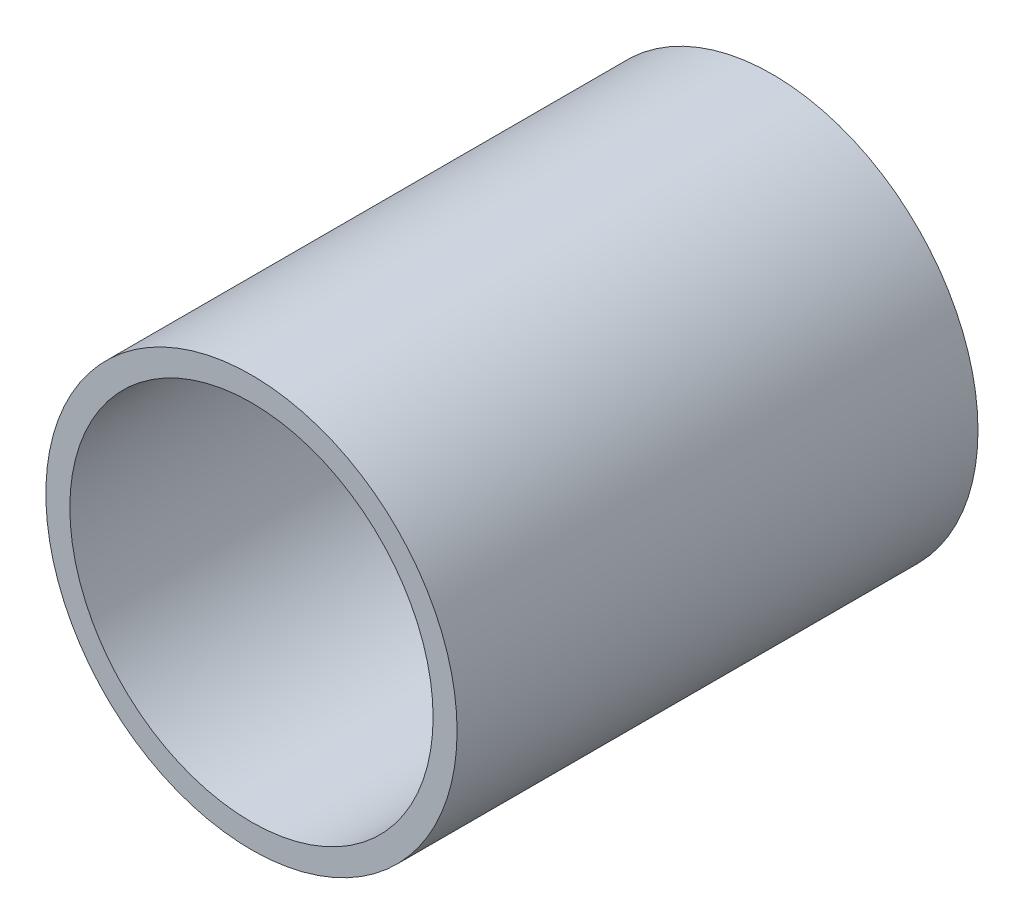
ISO-10303-21;
HEADER;
FILE_DESCRIPTION(('STEP AP214'),'2;1');
FILE_NAME('part.step','',(''),(''),'','','');
FILE_SCHEMA(('AUTOMOTIVE_DESIGN { 1 0 10303 214 1 1 1 1 }'));
ENDSEC;
DATA;
#1=APPLICATION_CONTEXT('core data for automotive mechanical design processes');
#2=APPLICATION_PROTOCOL_DEFINITION('international standard','automotive_design',2000,#1);
#3=PRODUCT_CONTEXT('',#1,'mechanical');
#4=PRODUCT('Part','Part','',(#3));
#5=PRODUCT_RELATED_PRODUCT_CATEGORY('part','',(#4));
#6=PRODUCT_DEFINITION_FORMATION('','',#4);
#7=PRODUCT_DEFINITION_CONTEXT('part definition',#1,'design');
#8=PRODUCT_DEFINITION('design','',#6,#7);
#9=PRODUCT_DEFINITION_SHAPE('','',#8);
#10=(LENGTH_UNIT() NAMED_UNIT(*) SI_UNIT(.MILLI.,.METRE.));
#11=(NAMED_UNIT(*) PLANE_ANGLE_UNIT() SI_UNIT($,.RADIAN.));
#12=(NAMED_UNIT(*) SI_UNIT($,.STERADIAN.) SOLID_ANGLE_UNIT());
#13=UNCERTAINTY_MEASURE_WITH_UNIT(LENGTH_MEASURE(1.E-05),#10,'distance_accuracy_value','');
#14=(GEOMETRIC_REPRESENTATION_CONTEXT(3) GLOBAL_UNCERTAINTY_ASSIGNED_CONTEXT((#13)) GLOBAL_UNIT_ASSIGNED_CONTEXT((#10,
#11,#12)) REPRESENTATION_CONTEXT('',''));
#15=CARTESIAN_POINT('',(0.,0.,0.));
#16=DIRECTION('',(0.,0.,1.));
#17=DIRECTION('',(1.,0.,0.));
#18=AXIS2_PLACEMENT_3D('',#15,#16,#17);
#19=CARTESIAN_POINT('',(0.,0.,48.26));
#20=DIRECTION('',(0.,0.,1.));
#21=DIRECTION('',(1.,0.,0.));
#22=AXIS2_PLACEMENT_3D('',#19,#20,#21);
#23=PLANE('',#22);
#24=CARTESIAN_POINT('',(0.,0.,48.26));
#25=DIRECTION('',(0.,0.,1.));
#26=DIRECTION('',(1.,0.,0.));
#27=AXIS2_PLACEMENT_3D('',#24,#25,#26);
#28=CIRCLE('',#27,19.05);
#29=CARTESIAN_POINT('',(19.05,0.,48.26));
#30=VERTEX_POINT('',#29);
#31=EDGE_CURVE('E10',#30,#30,#28,.T.);
#32=ORIENTED_EDGE('',*,*,#31,.T.);
#33=EDGE_LOOP('',(#32));
#34=FACE_BOUND('',#33,.T.);
#35=CARTESIAN_POINT('',(0.,0.,48.26));
#36=DIRECTION('',(0.,0.,1.));
#37=DIRECTION('',(1.,0.,0.));
#38=AXIS2_PLACEMENT_3D('',#35,#36,#37);
#39=CIRCLE('',#38,16.8275);
#40=CARTESIAN_POINT('',(16.8275,0.,48.26));
#41=VERTEX_POINT('',#40);
#42=EDGE_CURVE('E46',#41,#41,#39,.T.);
#43=ORIENTED_EDGE('',*,*,#42,.F.);
#44=EDGE_LOOP('',(#43));
#45=FACE_BOUND('',#44,.T.);
#46=ADVANCED_FACE('F35',(#34,#45),#23,.T.);
#47=CARTESIAN_POINT('',(0.,0.,0.));
#48=DIRECTION('',(0.,0.,1.));
#49=DIRECTION('',(1.,0.,0.));
#50=AXIS2_PLACEMENT_3D('',#47,#48,#49);
#51=PLANE('',#50);
#52=CARTESIAN_POINT('',(0.,0.,0.));
#53=DIRECTION('',(0.,0.,1.));
#54=DIRECTION('',(1.,0.,0.));
#55=AXIS2_PLACEMENT_3D('',#52,#53,#54);
#56=CIRCLE('',#55,19.05);
#57=CARTESIAN_POINT('',(19.05,0.,0.));
#58=VERTEX_POINT('',#57);
#59=EDGE_CURVE('E39',#58,#58,#56,.T.);
#60=ORIENTED_EDGE('',*,*,#59,.F.);
#61=EDGE_LOOP('',(#60));
#62=FACE_BOUND('',#61,.T.);
#63=CARTESIAN_POINT('',(0.,0.,0.));
#64=DIRECTION('',(0.,0.,1.));
#65=DIRECTION('',(1.,0.,0.));
#66=AXIS2_PLACEMENT_3D('',#63,#64,#65);
#67=CIRCLE('',#66,16.8275);
#68=CARTESIAN_POINT('',(16.8275,0.,0.));
#69=VERTEX_POINT('',#68);
#70=EDGE_CURVE('E48',#69,#69,#67,.T.);
#71=ORIENTED_EDGE('',*,*,#70,.T.);
#72=EDGE_LOOP('',(#71));
#73=FACE_BOUND('',#72,.T.);
#74=ADVANCED_FACE('F58',(#62,#73),#51,.F.);
#75=CARTESIAN_POINT('',(0.,0.,48.26));
#76=DIRECTION('',(0.,0.,-1.));
#77=DIRECTION('',(-1.,0.,0.));
#78=AXIS2_PLACEMENT_3D('',#75,#76,#77);
#79=CYLINDRICAL_SURFACE('',#78,19.05);
#80=ORIENTED_EDGE('',*,*,#31,.F.);
#81=EDGE_LOOP('',(#80));
#82=FACE_BOUND('',#81,.T.);
#83=ORIENTED_EDGE('',*,*,#59,.T.);
#84=EDGE_LOOP('',(#83));
#85=FACE_BOUND('',#84,.T.);
#86=ADVANCED_FACE('F37',(#82,#85),#79,.T.);
#87=CARTESIAN_POINT('',(0.,0.,48.26));
#88=DIRECTION('',(0.,0.,-1.));
#89=DIRECTION('',(-1.,0.,0.));
#90=AXIS2_PLACEMENT_3D('',#87,#88,#89);
#91=CYLINDRICAL_SURFACE('',#90,16.8275);
#92=ORIENTED_EDGE('',*,*,#42,.T.);
#93=EDGE_LOOP('',(#92));
#94=FACE_BOUND('',#93,.T.);
#95=ORIENTED_EDGE('',*,*,#70,.F.);
#96=EDGE_LOOP('',(#95));
#97=FACE_BOUND('',#96,.T.);
#98=ADVANCED_FACE('F54',(#94,#97),#91,.F.);
#99=CLOSED_SHELL('',(#46,#74,#86,#98));
#100=MANIFOLD_SOLID_BREP('B2',#99);
#101=ADVANCED_BREP_SHAPE_REPRESENTATION('',(#18,#100),#14);
#102=SHAPE_DEFINITION_REPRESENTATION(#9,#101);
ENDSEC;
END-ISO-10303-21;
